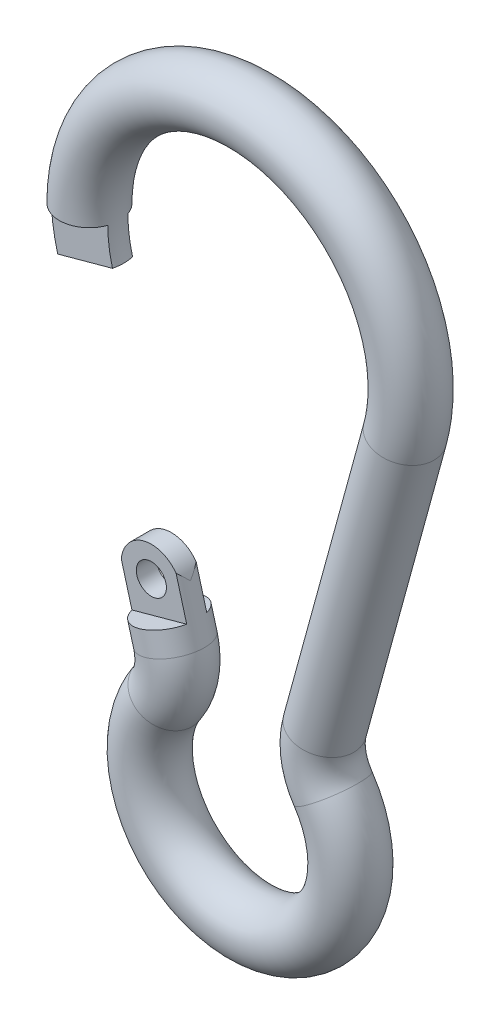
ISO-10303-21;
HEADER;
FILE_DESCRIPTION(('STEP AP214'),'2;1');
FILE_NAME('part.step','',(''),(''),'','','');
FILE_SCHEMA(('AUTOMOTIVE_DESIGN { 1 0 10303 214 1 1 1 1 }'));
ENDSEC;
DATA;
#1=APPLICATION_CONTEXT('core data for automotive mechanical design processes');
#2=APPLICATION_PROTOCOL_DEFINITION('international standard','automotive_design',2000,#1);
#3=PRODUCT_CONTEXT('',#1,'mechanical');
#4=PRODUCT('Part','Part','',(#3));
#5=PRODUCT_RELATED_PRODUCT_CATEGORY('part','',(#4));
#6=PRODUCT_DEFINITION_FORMATION('','',#4);
#7=PRODUCT_DEFINITION_CONTEXT('part definition',#1,'design');
#8=PRODUCT_DEFINITION('design','',#6,#7);
#9=PRODUCT_DEFINITION_SHAPE('','',#8);
#10=(LENGTH_UNIT() NAMED_UNIT(*) SI_UNIT(.MILLI.,.METRE.));
#11=(NAMED_UNIT(*) PLANE_ANGLE_UNIT() SI_UNIT($,.RADIAN.));
#12=(NAMED_UNIT(*) SI_UNIT($,.STERADIAN.) SOLID_ANGLE_UNIT());
#13=UNCERTAINTY_MEASURE_WITH_UNIT(LENGTH_MEASURE(1.E-05),#10,'distance_accuracy_value','');
#14=(GEOMETRIC_REPRESENTATION_CONTEXT(3) GLOBAL_UNCERTAINTY_ASSIGNED_CONTEXT((#13)) GLOBAL_UNIT_ASSIGNED_CONTEXT((#10,
#11,#12)) REPRESENTATION_CONTEXT('',''));
#15=CARTESIAN_POINT('',(0.,0.,0.));
#16=DIRECTION('',(0.,0.,1.));
#17=DIRECTION('',(1.,0.,0.));
#18=AXIS2_PLACEMENT_3D('',#15,#16,#17);
#19=CARTESIAN_POINT('',(-9.45089551176786,13.4418170272849,0.));
#20=DIRECTION('',(-0.26401798258332,0.964517757676153,0.));
#21=DIRECTION('',(-0.964517757676153,-0.26401798258332,0.));
#22=AXIS2_PLACEMENT_3D('',#19,#20,#21);
#23=CYLINDRICAL_SURFACE('',#22,3.81);
#24=DIRECTION('',(-0.26401798258332,0.964517757676153,0.));
#25=VECTOR('',#24,1.);
#26=CARTESIAN_POINT('',(-5.98624891286739,14.3901966689514,-1.27));
#27=LINE('',#26,#25);
#28=CARTESIAN_POINT('',(-8.08708612793937,22.0650329816043,-1.27));
#29=VERTEX_POINT('',#28);
#30=CARTESIAN_POINT('',(-6.74587477641609,17.1652827726094,-1.27));
#31=VERTEX_POINT('',#30);
#32=EDGE_CURVE('E174',#29,#31,#27,.F.);
#33=ORIENTED_EDGE('',*,*,#32,.F.);
#34=CARTESIAN_POINT('',(-11.216429888959,19.8917157876891,0.));
#35=DIRECTION('',(-0.186688905839857,0.682017047027651,0.707106781186547));
#36=DIRECTION('',(-0.186688905839857,0.682017047027651,-0.707106781186547));
#37=AXIS2_PLACEMENT_3D('',#34,#35,#36);
#38=ELLIPSE('',#37,5.38815367264149,3.81);
#39=CARTESIAN_POINT('',(-7.54161723221288,20.8976243013315,0.));
#40=VERTEX_POINT('',#39);
#41=EDGE_CURVE('E212',#29,#40,#38,.F.);
#42=ORIENTED_EDGE('',*,*,#41,.T.);
#43=CARTESIAN_POINT('',(-11.216429888959,19.8917157876891,0.));
#44=DIRECTION('',(-0.186688905839857,0.682017047027651,-0.707106781186547));
#45=DIRECTION('',(-0.186688905839857,0.682017047027651,0.707106781186547));
#46=AXIS2_PLACEMENT_3D('',#43,#44,#45);
#47=ELLIPSE('',#46,5.38815367264149,3.81);
#48=CARTESIAN_POINT('',(-8.08708612793937,22.0650329816043,1.27));
#49=VERTEX_POINT('',#48);
#50=EDGE_CURVE('E208',#40,#49,#47,.F.);
#51=ORIENTED_EDGE('',*,*,#50,.T.);
#52=DIRECTION('',(-0.26401798258332,0.964517757676153,0.));
#53=VECTOR('',#52,1.);
#54=CARTESIAN_POINT('',(-5.98624891286739,14.3901966689514,1.27));
#55=LINE('',#54,#53);
#56=CARTESIAN_POINT('',(-6.74587477641609,17.1652827726094,1.27));
#57=VERTEX_POINT('',#56);
#58=EDGE_CURVE('E119',#49,#57,#55,.F.);
#59=ORIENTED_EDGE('',*,*,#58,.T.);
#60=CARTESIAN_POINT('',(-10.2105213753166,16.2169031309429,0.));
#61=DIRECTION('',(0.26401798258332,-0.964517757676153,0.));
#62=DIRECTION('',(0.964517757676153,0.26401798258332,0.));
#63=AXIS2_PLACEMENT_3D('',#60,#61,#62);
#64=CIRCLE('',#63,3.81);
#65=CARTESIAN_POINT('',(-13.675167974217,15.2685234892765,1.27));
#66=VERTEX_POINT('',#65);
#67=EDGE_CURVE('E104',#66,#57,#64,.F.);
#68=ORIENTED_EDGE('',*,*,#67,.F.);
#69=DIRECTION('',(-0.26401798258332,0.964517757676153,0.));
#70=VECTOR('',#69,1.);
#71=CARTESIAN_POINT('',(-12.9155421106683,12.4934373856184,1.27));
#72=LINE('',#71,#70);
#73=CARTESIAN_POINT('',(-15.0163793257403,20.1682736982713,1.27));
#74=VERTEX_POINT('',#73);
#75=EDGE_CURVE('E198',#66,#74,#72,.T.);
#76=ORIENTED_EDGE('',*,*,#75,.T.);
#77=CARTESIAN_POINT('',(-14.8912425457051,18.8858072740466,0.));
#78=VERTEX_POINT('',#77);
#79=EDGE_CURVE('E207',#74,#78,#47,.F.);
#80=ORIENTED_EDGE('',*,*,#79,.T.);
#81=CARTESIAN_POINT('',(-15.0163793257403,20.1682736982713,-1.27));
#82=VERTEX_POINT('',#81);
#83=EDGE_CURVE('E182',#78,#82,#38,.F.);
#84=ORIENTED_EDGE('',*,*,#83,.T.);
#85=DIRECTION('',(-0.26401798258332,0.964517757676153,0.));
#86=VECTOR('',#85,1.);
#87=CARTESIAN_POINT('',(-12.9155421106683,12.4934373856184,-1.27));
#88=LINE('',#87,#86);
#89=CARTESIAN_POINT('',(-13.675167974217,15.2685234892765,-1.27));
#90=VERTEX_POINT('',#89);
#91=EDGE_CURVE('E111',#90,#82,#88,.T.);
#92=ORIENTED_EDGE('',*,*,#91,.F.);
#93=CARTESIAN_POINT('',(-10.2105213753166,16.2169031309429,0.));
#94=DIRECTION('',(-0.26401798258332,0.964517757676153,0.));
#95=DIRECTION('',(-0.964517757676153,-0.26401798258332,0.));
#96=AXIS2_PLACEMENT_3D('',#93,#94,#95);
#97=CIRCLE('',#96,3.81);
#98=EDGE_CURVE('E13',#90,#31,#97,.F.);
#99=ORIENTED_EDGE('',*,*,#98,.T.);
#100=EDGE_LOOP('',(#33,#42,#51,#59,#68,#76,#80,#84,#92,#99));
#101=FACE_BOUND('',#100,.T.);
#102=CARTESIAN_POINT('',(-9.45089551176786,13.4418170272849,0.));
#103=DIRECTION('',(-0.26401798258332,0.964517757676153,0.));
#104=DIRECTION('',(-0.964517757676153,-0.26401798258332,0.));
#105=AXIS2_PLACEMENT_3D('',#102,#103,#104);
#106=CIRCLE('',#105,3.81);
#107=CARTESIAN_POINT('',(-5.77608285502173,14.4477255409273,0.));
#108=VERTEX_POINT('',#107);
#109=EDGE_CURVE('E253',#108,#108,#106,.T.);
#110=ORIENTED_EDGE('',*,*,#109,.T.);
#111=EDGE_LOOP('',(#110));
#112=FACE_BOUND('',#111,.T.);
#113=ADVANCED_FACE('F95',(#101,#112),#23,.T.);
#114=CARTESIAN_POINT('',(-11.216429888959,19.8917157876891,-3.81));
#115=DIRECTION('',(0.,0.,1.));
#116=DIRECTION('',(1.,0.,0.));
#117=AXIS2_PLACEMENT_3D('',#114,#115,#116);
#118=CYLINDRICAL_SURFACE('',#117,3.80999999999999);
#119=CARTESIAN_POINT('',(-11.216429888959,19.8917157876891,-1.27));
#120=DIRECTION('',(0.,0.,1.));
#121=DIRECTION('',(1.,0.,0.));
#122=AXIS2_PLACEMENT_3D('',#119,#120,#121);
#123=CIRCLE('',#122,3.80999999999999);
#124=EDGE_CURVE('E176',#29,#82,#123,.T.);
#125=ORIENTED_EDGE('',*,*,#124,.T.);
#126=ORIENTED_EDGE('',*,*,#83,.F.);
#127=ORIENTED_EDGE('',*,*,#79,.F.);
#128=CARTESIAN_POINT('',(-11.216429888959,19.8917157876891,1.27));
#129=DIRECTION('',(0.,0.,1.));
#130=DIRECTION('',(1.,0.,0.));
#131=AXIS2_PLACEMENT_3D('',#128,#129,#130);
#132=CIRCLE('',#131,3.80999999999999);
#133=EDGE_CURVE('E195',#74,#49,#132,.F.);
#134=ORIENTED_EDGE('',*,*,#133,.T.);
#135=ORIENTED_EDGE('',*,*,#50,.F.);
#136=ORIENTED_EDGE('',*,*,#41,.F.);
#137=EDGE_LOOP('',(#125,#126,#127,#134,#135,#136));
#138=FACE_BOUND('',#137,.T.);
#139=ADVANCED_FACE('F284',(#138),#118,.T.);
#140=CARTESIAN_POINT('',(-11.216429888959,19.8917157876891,-3.81));
#141=DIRECTION('',(0.,0.,1.));
#142=DIRECTION('',(1.,0.,0.));
#143=AXIS2_PLACEMENT_3D('',#140,#141,#142);
#144=CYLINDRICAL_SURFACE('',#143,1.905);
#145=CARTESIAN_POINT('',(-11.216429888959,19.8917157876891,-1.27));
#146=DIRECTION('',(0.,0.,1.));
#147=DIRECTION('',(1.,0.,0.));
#148=AXIS2_PLACEMENT_3D('',#145,#146,#147);
#149=CIRCLE('',#148,1.905);
#150=CARTESIAN_POINT('',(-9.31142988895902,19.8917157876891,-1.27));
#151=VERTEX_POINT('',#150);
#152=EDGE_CURVE('E177',#151,#151,#149,.T.);
#153=CARTESIAN_POINT('',(-11.216429888959,19.8917157876891,1.27));
#154=DIRECTION('',(0.,0.,1.));
#155=DIRECTION('',(1.,0.,0.));
#156=AXIS2_PLACEMENT_3D('',#153,#154,#155);
#157=CIRCLE('',#156,1.905);
#158=CARTESIAN_POINT('',(-9.31142988895902,19.8917157876891,1.27));
#159=VERTEX_POINT('',#158);
#160=EDGE_CURVE('E187',#159,#159,#157,.F.);
#161=CARTESIAN_POINT('',(-9.31142988895902,19.8917157876891,-1.27));
#162=CARTESIAN_POINT('',(-9.31142988895902,19.8917157876891,-1.24354166666667));
#163=CARTESIAN_POINT('',(-9.31142988895902,19.8917157876891,-1.21708333333333));
#164=CARTESIAN_POINT('',(-9.31142988895902,19.8917157876891,-1.16416666666667));
#165=CARTESIAN_POINT('',(-9.31142988895902,19.8917157876891,-1.13770833333333));
#166=CARTESIAN_POINT('',(-9.31142988895902,19.8917157876891,-1.08479166666667));
#167=CARTESIAN_POINT('',(-9.31142988895902,19.8917157876891,-1.05833333333333));
#168=CARTESIAN_POINT('',(-9.31142988895902,19.8917157876891,-1.00541666666667));
#169=CARTESIAN_POINT('',(-9.31142988895902,19.8917157876891,-0.978958333333334));
#170=CARTESIAN_POINT('',(-9.31142988895902,19.8917157876891,-0.926041666666667));
#171=CARTESIAN_POINT('',(-9.31142988895902,19.8917157876891,-0.899583333333334));
#172=CARTESIAN_POINT('',(-9.31142988895902,19.8917157876891,-0.846666666666667));
#173=CARTESIAN_POINT('',(-9.31142988895902,19.8917157876891,-0.820208333333334));
#174=CARTESIAN_POINT('',(-9.31142988895902,19.8917157876891,-0.767291666666667));
#175=CARTESIAN_POINT('',(-9.31142988895902,19.8917157876891,-0.740833333333334));
#176=CARTESIAN_POINT('',(-9.31142988895902,19.8917157876891,-0.687916666666667));
#177=CARTESIAN_POINT('',(-9.31142988895902,19.8917157876891,-0.661458333333334));
#178=CARTESIAN_POINT('',(-9.31142988895902,19.8917157876891,-0.608541666666667));
#179=CARTESIAN_POINT('',(-9.31142988895902,19.8917157876891,-0.582083333333334));
#180=CARTESIAN_POINT('',(-9.31142988895902,19.8917157876891,-0.529166666666667));
#181=CARTESIAN_POINT('',(-9.31142988895902,19.8917157876891,-0.502708333333334));
#182=CARTESIAN_POINT('',(-9.31142988895902,19.8917157876891,-0.449791666666667));
#183=CARTESIAN_POINT('',(-9.31142988895902,19.8917157876891,-0.423333333333334));
#184=CARTESIAN_POINT('',(-9.31142988895902,19.8917157876891,-0.370416666666667));
#185=CARTESIAN_POINT('',(-9.31142988895902,19.8917157876891,-0.343958333333334));
#186=CARTESIAN_POINT('',(-9.31142988895902,19.8917157876891,-0.291041666666667));
#187=CARTESIAN_POINT('',(-9.31142988895902,19.8917157876891,-0.264583333333334));
#188=CARTESIAN_POINT('',(-9.31142988895902,19.8917157876891,-0.211666666666667));
#189=CARTESIAN_POINT('',(-9.31142988895902,19.8917157876891,-0.185208333333334));
#190=CARTESIAN_POINT('',(-9.31142988895902,19.8917157876891,-0.132291666666667));
#191=CARTESIAN_POINT('',(-9.31142988895902,19.8917157876891,-0.105833333333334));
#192=CARTESIAN_POINT('',(-9.31142988895902,19.8917157876891,-0.0529166666666671));
#193=CARTESIAN_POINT('',(-9.31142988895902,19.8917157876891,-0.0264583333333338));
#194=CARTESIAN_POINT('',(-9.31142988895902,19.8917157876891,0.0264583333333329));
#195=CARTESIAN_POINT('',(-9.31142988895902,19.8917157876891,0.0529166666666662));
#196=CARTESIAN_POINT('',(-9.31142988895902,19.8917157876891,0.105833333333333));
#197=CARTESIAN_POINT('',(-9.31142988895902,19.8917157876891,0.132291666666666));
#198=CARTESIAN_POINT('',(-9.31142988895902,19.8917157876891,0.185208333333333));
#199=CARTESIAN_POINT('',(-9.31142988895902,19.8917157876891,0.211666666666666));
#200=CARTESIAN_POINT('',(-9.31142988895902,19.8917157876891,0.264583333333333));
#201=CARTESIAN_POINT('',(-9.31142988895902,19.8917157876891,0.291041666666666));
#202=CARTESIAN_POINT('',(-9.31142988895902,19.8917157876891,0.343958333333332));
#203=CARTESIAN_POINT('',(-9.31142988895902,19.8917157876891,0.370416666666666));
#204=CARTESIAN_POINT('',(-9.31142988895902,19.8917157876891,0.423333333333332));
#205=CARTESIAN_POINT('',(-9.31142988895902,19.8917157876891,0.449791666666666));
#206=CARTESIAN_POINT('',(-9.31142988895902,19.8917157876891,0.502708333333333));
#207=CARTESIAN_POINT('',(-9.31142988895902,19.8917157876891,0.529166666666666));
#208=CARTESIAN_POINT('',(-9.31142988895902,19.8917157876891,0.582083333333333));
#209=CARTESIAN_POINT('',(-9.31142988895902,19.8917157876891,0.608541666666666));
#210=CARTESIAN_POINT('',(-9.31142988895902,19.8917157876891,0.661458333333332));
#211=CARTESIAN_POINT('',(-9.31142988895902,19.8917157876891,0.687916666666666));
#212=CARTESIAN_POINT('',(-9.31142988895902,19.8917157876891,0.740833333333332));
#213=CARTESIAN_POINT('',(-9.31142988895902,19.8917157876891,0.767291666666666));
#214=CARTESIAN_POINT('',(-9.31142988895902,19.8917157876891,0.820208333333333));
#215=CARTESIAN_POINT('',(-9.31142988895902,19.8917157876891,0.846666666666666));
#216=CARTESIAN_POINT('',(-9.31142988895902,19.8917157876891,0.899583333333333));
#217=CARTESIAN_POINT('',(-9.31142988895902,19.8917157876891,0.926041666666666));
#218=CARTESIAN_POINT('',(-9.31142988895902,19.8917157876891,0.978958333333333));
#219=CARTESIAN_POINT('',(-9.31142988895902,19.8917157876891,1.00541666666667));
#220=CARTESIAN_POINT('',(-9.31142988895902,19.8917157876891,1.05833333333333));
#221=CARTESIAN_POINT('',(-9.31142988895902,19.8917157876891,1.08479166666667));
#222=CARTESIAN_POINT('',(-9.31142988895902,19.8917157876891,1.13770833333333));
#223=CARTESIAN_POINT('',(-9.31142988895902,19.8917157876891,1.16416666666667));
#224=CARTESIAN_POINT('',(-9.31142988895902,19.8917157876891,1.21708333333333));
#225=CARTESIAN_POINT('',(-9.31142988895902,19.8917157876891,1.24354166666667));
#226=CARTESIAN_POINT('',(-9.31142988895902,19.8917157876891,1.27));
#227=B_SPLINE_CURVE_WITH_KNOTS('',3,(#161,#162,#163,#164,#165,#166,#167,#168,#169,#170,#171,
#172,#173,#174,#175,#176,#177,#178,#179,#180,#181,#182,#183,#184,#185,#186,#187,#188,#189,#190,
#191,#192,#193,#194,#195,#196,#197,#198,#199,#200,#201,#202,#203,#204,#205,#206,#207,#208,#209,
#210,#211,#212,#213,#214,#215,#216,#217,#218,#219,#220,#221,#222,#223,#224,#225,#226),
.UNSPECIFIED.,.F.,.F.,(4,2,2,2,2,2,2,2,2,2,2,2,2,2,2,2,2,2,2,2,2,2,2,2,2,2,2,2,2,2,2,2,4),(0.,
0.079375,0.15875,0.238125,0.3175,0.396875,0.47625,0.555625,0.635,0.714375,0.79375,0.873125,
0.9525,1.031875,1.11125,1.190625,1.27,1.349375,1.42875,1.508125,1.5875,1.666875,1.74625,
1.825625,1.905,1.984375,2.06375,2.143125,2.2225,2.301875,2.38125,2.460625,2.54),.UNSPECIFIED.);
#228=EDGE_CURVE('BSEAM322',#151,#159,#227,.T.);
#229=ORIENTED_EDGE('',*,*,#152,.F.);
#230=ORIENTED_EDGE('',*,*,#160,.F.);
#231=ORIENTED_EDGE('',*,*,#228,.T.);
#232=ORIENTED_EDGE('',*,*,#228,.F.);
#233=EDGE_LOOP('',(#229,#231,#230,#232));
#234=FACE_BOUND('',#233,.T.);
#235=ADVANCED_FACE('F322',(#234),#144,.F.);
#236=CARTESIAN_POINT('',(0.,55.88,0.));
#237=DIRECTION('',(0.,0.,-1.));
#238=DIRECTION('',(-1.,0.,0.));
#239=AXIS2_PLACEMENT_3D('',#236,#237,#238);
#240=TOROIDAL_SURFACE('',#239,20.32,3.81);
#241=CARTESIAN_POINT('',(0.,55.88,-1.27));
#242=DIRECTION('',(0.,0.,1.));
#243=DIRECTION('',(1.,0.,0.));
#244=AXIS2_PLACEMENT_3D('',#241,#242,#243);
#245=CIRCLE('',#244,23.9121024484277);
#246=CARTESIAN_POINT('',(-23.0636474348799,49.5667749522405,-1.27));
#247=VERTEX_POINT('',#246);
#248=CARTESIAN_POINT('',(-23.9121024484277,55.8799999999998,-1.27));
#249=VERTEX_POINT('',#248);
#250=EDGE_CURVE('E222',#247,#249,#245,.F.);
#251=ORIENTED_EDGE('',*,*,#250,.F.);
#252=CARTESIAN_POINT('',(-19.5990008359794,50.5151545939069,0.));
#253=DIRECTION('',(-0.26401798258332,0.964517757676153,0.));
#254=DIRECTION('',(-0.964517757676153,-0.26401798258332,0.));
#255=AXIS2_PLACEMENT_3D('',#252,#253,#254);
#256=CIRCLE('',#255,3.81);
#257=CARTESIAN_POINT('',(-23.0636474348799,49.5667749522405,1.27));
#258=VERTEX_POINT('',#257);
#259=EDGE_CURVE('E257',#247,#258,#256,.T.);
#260=ORIENTED_EDGE('',*,*,#259,.T.);
#261=CARTESIAN_POINT('',(0.,55.88,1.27));
#262=DIRECTION('',(0.,0.,1.));
#263=DIRECTION('',(1.,0.,0.));
#264=AXIS2_PLACEMENT_3D('',#261,#262,#263);
#265=CIRCLE('',#264,23.9121024484277);
#266=CARTESIAN_POINT('',(-23.9121024484277,55.8799999999998,1.27));
#267=VERTEX_POINT('',#266);
#268=EDGE_CURVE('E233',#258,#267,#265,.F.);
#269=ORIENTED_EDGE('',*,*,#268,.T.);
#270=CARTESIAN_POINT('',(-20.32,55.8799999999999,0.));
#271=DIRECTION('',(0.,1.,0.));
#272=DIRECTION('',(-1.,0.,0.));
#273=AXIS2_PLACEMENT_3D('',#270,#271,#272);
#274=CIRCLE('',#273,3.81);
#275=CARTESIAN_POINT('',(-16.7278975515723,55.8799999999999,1.27));
#276=VERTEX_POINT('',#275);
#277=EDGE_CURVE('E265',#276,#267,#274,.F.);
#278=ORIENTED_EDGE('',*,*,#277,.F.);
#279=CARTESIAN_POINT('',(0.,55.88,1.27));
#280=DIRECTION('',(0.,0.,-1.));
#281=DIRECTION('',(-1.,0.,0.));
#282=AXIS2_PLACEMENT_3D('',#279,#280,#281);
#283=CIRCLE('',#282,16.7278975515723);
#284=CARTESIAN_POINT('',(-16.134354237079,51.4635342355734,1.27));
#285=VERTEX_POINT('',#284);
#286=EDGE_CURVE('E229',#276,#285,#283,.F.);
#287=ORIENTED_EDGE('',*,*,#286,.T.);
#288=CARTESIAN_POINT('',(-16.134354237079,51.4635342355734,-1.27));
#289=VERTEX_POINT('',#288);
#290=EDGE_CURVE('E258',#285,#289,#256,.T.);
#291=ORIENTED_EDGE('',*,*,#290,.T.);
#292=CARTESIAN_POINT('',(0.,55.88,-1.27));
#293=DIRECTION('',(0.,0.,-1.));
#294=DIRECTION('',(-1.,0.,0.));
#295=AXIS2_PLACEMENT_3D('',#292,#293,#294);
#296=CIRCLE('',#295,16.7278975515723);
#297=CARTESIAN_POINT('',(-16.7278975515723,55.8799999999999,-1.27));
#298=VERTEX_POINT('',#297);
#299=EDGE_CURVE('E219',#298,#289,#296,.F.);
#300=ORIENTED_EDGE('',*,*,#299,.F.);
#301=CARTESIAN_POINT('',(-20.32,55.8799999999999,0.));
#302=DIRECTION('',(0.,-1.,0.));
#303=DIRECTION('',(1.,0.,0.));
#304=AXIS2_PLACEMENT_3D('',#301,#302,#303);
#305=CIRCLE('',#304,3.81);
#306=EDGE_CURVE('E272',#298,#249,#305,.F.);
#307=ORIENTED_EDGE('',*,*,#306,.T.);
#308=EDGE_LOOP('',(#251,#260,#269,#278,#287,#291,#300,#307));
#309=FACE_BOUND('',#308,.T.);
#310=CARTESIAN_POINT('',(19.5990008359794,50.5151545939069,0.));
#311=DIRECTION('',(-0.26401798258332,-0.964517757676153,0.));
#312=DIRECTION('',(0.964517757676153,-0.26401798258332,0.));
#313=AXIS2_PLACEMENT_3D('',#310,#311,#312);
#314=CIRCLE('',#313,3.81);
#315=CARTESIAN_POINT('',(23.2738134927256,49.5092460802645,0.));
#316=VERTEX_POINT('',#315);
#317=EDGE_CURVE('E237',#316,#316,#314,.T.);
#318=ORIENTED_EDGE('',*,*,#317,.F.);
#319=EDGE_LOOP('',(#318));
#320=FACE_BOUND('',#319,.T.);
#321=ADVANCED_FACE('F97',(#309,#320),#240,.T.);
#322=CARTESIAN_POINT('',(-15.9241881792333,51.5210631075494,-3.81));
#323=DIRECTION('',(-0.264017982583321,0.964517757676152,0.));
#324=DIRECTION('',(-0.964517757676153,-0.264017982583321,0.));
#325=AXIS2_PLACEMENT_3D('',#322,#323,#324);
#326=PLANE('',#325);
#327=ORIENTED_EDGE('',*,*,#259,.F.);
#328=DIRECTION('',(0.964517757676153,0.264017982583321,0.));
#329=VECTOR('',#328,1.);
#330=CARTESIAN_POINT('',(-15.9241881792333,51.5210631075494,-1.27));
#331=LINE('',#330,#329);
#332=EDGE_CURVE('E268',#247,#289,#331,.T.);
#333=ORIENTED_EDGE('',*,*,#332,.T.);
#334=ORIENTED_EDGE('',*,*,#290,.F.);
#335=DIRECTION('',(0.964517757676153,0.264017982583321,0.));
#336=VECTOR('',#335,1.);
#337=CARTESIAN_POINT('',(-15.9241881792333,51.5210631075494,1.27));
#338=LINE('',#337,#336);
#339=EDGE_CURVE('E262',#258,#285,#338,.T.);
#340=ORIENTED_EDGE('',*,*,#339,.F.);
#341=EDGE_LOOP('',(#327,#333,#334,#340));
#342=FACE_BOUND('',#341,.T.);
#343=ADVANCED_FACE('F301',(#342),#326,.F.);
#344=CARTESIAN_POINT('',(-16.8005208252601,11.43,0.));
#345=DIRECTION('',(0.,0.,1.));
#346=DIRECTION('',(1.,0.,0.));
#347=AXIS2_PLACEMENT_3D('',#344,#345,#346);
#348=TOROIDAL_SURFACE('',#347,7.62,3.81);
#349=CARTESIAN_POINT('',(-10.5003255157876,7.14375,0.));
#350=DIRECTION('',(0.5625,0.826797284707685,0.));
#351=DIRECTION('',(-0.826797284707685,0.5625,0.));
#352=AXIS2_PLACEMENT_3D('',#349,#350,#351);
#353=CIRCLE('',#352,3.81);
#354=CARTESIAN_POINT('',(-7.35022786105132,5.000625,0.));
#355=VERTEX_POINT('',#354);
#356=EDGE_CURVE('E249',#355,#355,#353,.T.);
#357=CARTESIAN_POINT('',(-16.8005208252601,11.43,0.));
#358=DIRECTION('',(0.,0.,1.));
#359=DIRECTION('',(1.,0.,0.));
#360=AXIS2_PLACEMENT_3D('',#357,#358,#359);
#361=CIRCLE('',#360,11.43);
#362=EDGE_CURVE('',#355,#108,#361,.T.);
#363=ORIENTED_EDGE('',*,*,#356,.T.);
#364=ORIENTED_EDGE('',*,*,#109,.F.);
#365=ORIENTED_EDGE('',*,*,#362,.T.);
#366=ORIENTED_EDGE('',*,*,#362,.F.);
#367=EDGE_LOOP('',(#363,#365,#364,#366));
#368=FACE_BOUND('',#367,.T.);
#369=ADVANCED_FACE('F325',(#368),#348,.T.);
#370=CARTESIAN_POINT('',(0.,0.,0.));
#371=DIRECTION('',(0.,0.,-1.));
#372=DIRECTION('',(-1.,0.,0.));
#373=AXIS2_PLACEMENT_3D('',#370,#371,#372);
#374=TOROIDAL_SURFACE('',#373,12.7,3.81);
#375=ORIENTED_EDGE('',*,*,#356,.F.);
#376=EDGE_LOOP('',(#375));
#377=FACE_BOUND('',#376,.T.);
#378=CARTESIAN_POINT('',(10.5003255157876,7.14375,0.));
#379=DIRECTION('',(0.5625,-0.826797284707685,0.));
#380=DIRECTION('',(0.826797284707685,0.5625,0.));
#381=AXIS2_PLACEMENT_3D('',#378,#379,#380);
#382=CIRCLE('',#381,3.81);
#383=CARTESIAN_POINT('',(7.35022786105131,5.00062500000001,0.));
#384=VERTEX_POINT('',#383);
#385=EDGE_CURVE('E245',#384,#384,#382,.T.);
#386=ORIENTED_EDGE('',*,*,#385,.T.);
#387=EDGE_LOOP('',(#386));
#388=FACE_BOUND('',#387,.T.);
#389=ADVANCED_FACE('F328',(#377,#388),#374,.T.);
#390=CARTESIAN_POINT('',(16.8005208252601,11.43,0.));
#391=DIRECTION('',(0.,0.,1.));
#392=DIRECTION('',(1.,0.,0.));
#393=AXIS2_PLACEMENT_3D('',#390,#391,#392);
#394=TOROIDAL_SURFACE('',#393,7.62,3.81);
#395=CARTESIAN_POINT('',(9.45089551176786,13.4418170272849,0.));
#396=DIRECTION('',(-0.26401798258332,-0.964517757676153,0.));
#397=DIRECTION('',(0.964517757676153,-0.26401798258332,0.));
#398=AXIS2_PLACEMENT_3D('',#395,#396,#397);
#399=CIRCLE('',#398,3.81);
#400=CARTESIAN_POINT('',(5.77608285502173,14.4477255409273,0.));
#401=VERTEX_POINT('',#400);
#402=EDGE_CURVE('E241',#401,#401,#399,.T.);
#403=CARTESIAN_POINT('',(16.8005208252601,11.43,0.));
#404=DIRECTION('',(0.,0.,1.));
#405=DIRECTION('',(1.,0.,0.));
#406=AXIS2_PLACEMENT_3D('',#403,#404,#405);
#407=CIRCLE('',#406,11.43);
#408=EDGE_CURVE('',#401,#384,#407,.T.);
#409=ORIENTED_EDGE('',*,*,#402,.T.);
#410=ORIENTED_EDGE('',*,*,#385,.F.);
#411=ORIENTED_EDGE('',*,*,#408,.T.);
#412=ORIENTED_EDGE('',*,*,#408,.F.);
#413=EDGE_LOOP('',(#409,#411,#410,#412));
#414=FACE_BOUND('',#413,.T.);
#415=ADVANCED_FACE('F314',(#414),#394,.T.);
#416=CARTESIAN_POINT('',(19.5990008359794,50.5151545939069,0.));
#417=DIRECTION('',(-0.26401798258332,-0.964517757676153,0.));
#418=DIRECTION('',(0.964517757676153,-0.26401798258332,0.));
#419=AXIS2_PLACEMENT_3D('',#416,#417,#418);
#420=CYLINDRICAL_SURFACE('',#419,3.81);
#421=ORIENTED_EDGE('',*,*,#402,.F.);
#422=EDGE_LOOP('',(#421));
#423=FACE_BOUND('',#422,.T.);
#424=ORIENTED_EDGE('',*,*,#317,.T.);
#425=EDGE_LOOP('',(#424));
#426=FACE_BOUND('',#425,.T.);
#427=ADVANCED_FACE('F306',(#423,#426),#420,.T.);
#428=CARTESIAN_POINT('',(-16.51,55.8799999999999,-10.3885443226498));
#429=DIRECTION('',(0.,1.,0.));
#430=DIRECTION('',(-1.,0.,0.));
#431=AXIS2_PLACEMENT_3D('',#428,#429,#430);
#432=PLANE('',#431);
#433=ORIENTED_EDGE('',*,*,#277,.T.);
#434=DIRECTION('',(1.,0.,0.));
#435=VECTOR('',#434,1.);
#436=CARTESIAN_POINT('',(-16.51,55.8799999999999,1.27));
#437=LINE('',#436,#435);
#438=EDGE_CURVE('E225',#267,#276,#437,.T.);
#439=ORIENTED_EDGE('',*,*,#438,.T.);
#440=EDGE_LOOP('',(#433,#439));
#441=FACE_BOUND('',#440,.T.);
#442=ADVANCED_FACE('F304',(#441),#432,.F.);
#443=CARTESIAN_POINT('',(0.,0.,1.27));
#444=DIRECTION('',(0.,0.,1.));
#445=DIRECTION('',(1.,0.,0.));
#446=AXIS2_PLACEMENT_3D('',#443,#444,#445);
#447=PLANE('',#446);
#448=ORIENTED_EDGE('',*,*,#339,.T.);
#449=ORIENTED_EDGE('',*,*,#286,.F.);
#450=ORIENTED_EDGE('',*,*,#438,.F.);
#451=ORIENTED_EDGE('',*,*,#268,.F.);
#452=EDGE_LOOP('',(#448,#449,#450,#451));
#453=FACE_BOUND('',#452,.T.);
#454=ADVANCED_FACE('F299',(#453),#447,.T.);
#455=CARTESIAN_POINT('',(-16.51,55.8799999999999,10.3885443226498));
#456=DIRECTION('',(0.,-1.,0.));
#457=DIRECTION('',(1.,0.,0.));
#458=AXIS2_PLACEMENT_3D('',#455,#456,#457);
#459=PLANE('',#458);
#460=DIRECTION('',(-1.,0.,0.));
#461=VECTOR('',#460,1.);
#462=CARTESIAN_POINT('',(-16.51,55.8799999999999,-1.27));
#463=LINE('',#462,#461);
#464=EDGE_CURVE('E215',#298,#249,#463,.T.);
#465=ORIENTED_EDGE('',*,*,#464,.T.);
#466=ORIENTED_EDGE('',*,*,#306,.F.);
#467=EDGE_LOOP('',(#465,#466));
#468=FACE_BOUND('',#467,.T.);
#469=ADVANCED_FACE('F312',(#468),#459,.T.);
#470=CARTESIAN_POINT('',(0.,0.,-1.27));
#471=DIRECTION('',(0.,0.,1.));
#472=DIRECTION('',(1.,0.,0.));
#473=AXIS2_PLACEMENT_3D('',#470,#471,#472);
#474=PLANE('',#473);
#475=ORIENTED_EDGE('',*,*,#250,.T.);
#476=ORIENTED_EDGE('',*,*,#464,.F.);
#477=ORIENTED_EDGE('',*,*,#299,.T.);
#478=ORIENTED_EDGE('',*,*,#332,.F.);
#479=EDGE_LOOP('',(#475,#476,#477,#478));
#480=FACE_BOUND('',#479,.T.);
#481=ADVANCED_FACE('F353',(#480),#474,.F.);
#482=CARTESIAN_POINT('',(-4.84136435808839,17.6866054693188,-12.0076930334919));
#483=DIRECTION('',(0.26401798258332,-0.964517757676153,0.));
#484=DIRECTION('',(0.964517757676153,0.26401798258332,0.));
#485=AXIS2_PLACEMENT_3D('',#482,#483,#484);
#486=PLANE('',#485);
#487=ORIENTED_EDGE('',*,*,#67,.T.);
#488=DIRECTION('',(-0.964517757676153,-0.26401798258332,0.));
#489=VECTOR('',#488,1.);
#490=CARTESIAN_POINT('',(-4.84136435808839,17.6866054693188,1.27));
#491=LINE('',#490,#489);
#492=EDGE_CURVE('E194',#57,#66,#491,.T.);
#493=ORIENTED_EDGE('',*,*,#492,.T.);
#494=EDGE_LOOP('',(#487,#493));
#495=FACE_BOUND('',#494,.T.);
#496=ADVANCED_FACE('F278',(#495),#486,.F.);
#497=CARTESIAN_POINT('',(0.,0.,1.27));
#498=DIRECTION('',(0.,0.,1.));
#499=DIRECTION('',(1.,0.,0.));
#500=AXIS2_PLACEMENT_3D('',#497,#498,#499);
#501=PLANE('',#500);
#502=ORIENTED_EDGE('',*,*,#133,.F.);
#503=ORIENTED_EDGE('',*,*,#75,.F.);
#504=ORIENTED_EDGE('',*,*,#492,.F.);
#505=ORIENTED_EDGE('',*,*,#58,.F.);
#506=EDGE_LOOP('',(#502,#503,#504,#505));
#507=FACE_BOUND('',#506,.T.);
#508=ORIENTED_EDGE('',*,*,#160,.T.);
#509=EDGE_LOOP('',(#508));
#510=FACE_BOUND('',#509,.T.);
#511=ADVANCED_FACE('F279',(#507,#510),#501,.T.);
#512=CARTESIAN_POINT('',(-4.84136435808839,17.6866054693188,12.0076930334919));
#513=DIRECTION('',(-0.26401798258332,0.964517757676153,0.));
#514=DIRECTION('',(-0.964517757676153,-0.26401798258332,0.));
#515=AXIS2_PLACEMENT_3D('',#512,#513,#514);
#516=PLANE('',#515);
#517=DIRECTION('',(0.964517757676153,0.26401798258332,0.));
#518=VECTOR('',#517,1.);
#519=CARTESIAN_POINT('',(-4.84136435808839,17.6866054693188,-1.27));
#520=LINE('',#519,#518);
#521=EDGE_CURVE('E169',#90,#31,#520,.T.);
#522=ORIENTED_EDGE('',*,*,#521,.T.);
#523=ORIENTED_EDGE('',*,*,#98,.F.);
#524=EDGE_LOOP('',(#522,#523));
#525=FACE_BOUND('',#524,.T.);
#526=ADVANCED_FACE('F168',(#525),#516,.T.);
#527=CARTESIAN_POINT('',(0.,0.,-1.27));
#528=DIRECTION('',(0.,0.,1.));
#529=DIRECTION('',(1.,0.,0.));
#530=AXIS2_PLACEMENT_3D('',#527,#528,#529);
#531=PLANE('',#530);
#532=ORIENTED_EDGE('',*,*,#32,.T.);
#533=ORIENTED_EDGE('',*,*,#521,.F.);
#534=ORIENTED_EDGE('',*,*,#91,.T.);
#535=ORIENTED_EDGE('',*,*,#124,.F.);
#536=EDGE_LOOP('',(#532,#533,#534,#535));
#537=FACE_BOUND('',#536,.T.);
#538=ORIENTED_EDGE('',*,*,#152,.T.);
#539=EDGE_LOOP('',(#538));
#540=FACE_BOUND('',#539,.T.);
#541=ADVANCED_FACE('F172',(#537,#540),#531,.F.);
#542=CLOSED_SHELL('',(#113,#139,#235,#321,#343,#369,#389,#415,#427,#442,#454,#469,#481,#496,
#511,#526,#541));
#543=MANIFOLD_SOLID_BREP('B2',#542);
#544=ADVANCED_BREP_SHAPE_REPRESENTATION('',(#18,#543),#14);
#545=SHAPE_DEFINITION_REPRESENTATION(#9,#544);
ENDSEC;
END-ISO-10303-21;
